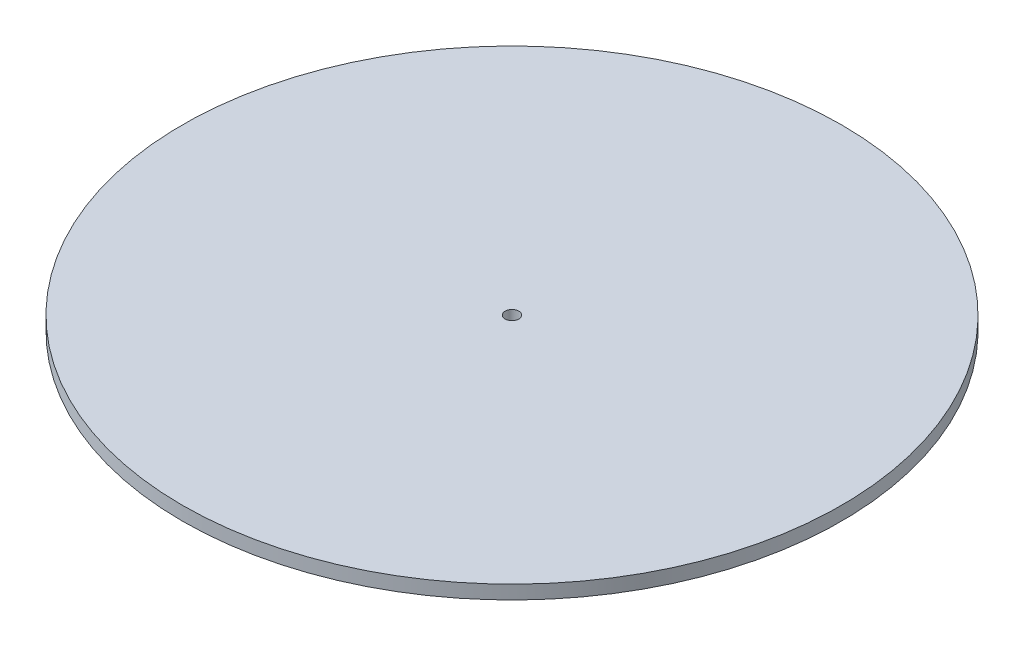
ISO-10303-21;
HEADER;
FILE_DESCRIPTION(('STEP AP214'),'2;1');
FILE_NAME('part.step','',(''),(''),'','','');
FILE_SCHEMA(('AUTOMOTIVE_DESIGN { 1 0 10303 214 1 1 1 1 }'));
ENDSEC;
DATA;
#1=APPLICATION_CONTEXT('core data for automotive mechanical design processes');
#2=APPLICATION_PROTOCOL_DEFINITION('international standard','automotive_design',2000,#1);
#3=PRODUCT_CONTEXT('',#1,'mechanical');
#4=PRODUCT('Part','Part','',(#3));
#5=PRODUCT_RELATED_PRODUCT_CATEGORY('part','',(#4));
#6=PRODUCT_DEFINITION_FORMATION('','',#4);
#7=PRODUCT_DEFINITION_CONTEXT('part definition',#1,'design');
#8=PRODUCT_DEFINITION('design','',#6,#7);
#9=PRODUCT_DEFINITION_SHAPE('','',#8);
#10=(LENGTH_UNIT() NAMED_UNIT(*) SI_UNIT(.MILLI.,.METRE.));
#11=(NAMED_UNIT(*) PLANE_ANGLE_UNIT() SI_UNIT($,.RADIAN.));
#12=(NAMED_UNIT(*) SI_UNIT($,.STERADIAN.) SOLID_ANGLE_UNIT());
#13=UNCERTAINTY_MEASURE_WITH_UNIT(LENGTH_MEASURE(1.E-05),#10,'distance_accuracy_value','');
#14=(GEOMETRIC_REPRESENTATION_CONTEXT(3) GLOBAL_UNCERTAINTY_ASSIGNED_CONTEXT((#13)) GLOBAL_UNIT_ASSIGNED_CONTEXT((#10,
#11,#12)) REPRESENTATION_CONTEXT('',''));
#15=CARTESIAN_POINT('',(0.,0.,0.));
#16=DIRECTION('',(0.,0.,1.));
#17=DIRECTION('',(1.,0.,0.));
#18=AXIS2_PLACEMENT_3D('',#15,#16,#17);
#19=CARTESIAN_POINT('',(0.,6.35,0.));
#20=DIRECTION('',(0.,1.,0.));
#21=DIRECTION('',(0.,0.,1.));
#22=AXIS2_PLACEMENT_3D('',#19,#20,#21);
#23=PLANE('',#22);
#24=CARTESIAN_POINT('',(0.,6.35,0.));
#25=DIRECTION('',(0.,1.,0.));
#26=DIRECTION('',(0.,0.,1.));
#27=AXIS2_PLACEMENT_3D('',#24,#25,#26);
#28=CIRCLE('',#27,152.4);
#29=CARTESIAN_POINT('',(0.,6.35,152.4));
#30=VERTEX_POINT('',#29);
#31=EDGE_CURVE('E10',#30,#30,#28,.T.);
#32=ORIENTED_EDGE('',*,*,#31,.T.);
#33=EDGE_LOOP('',(#32));
#34=FACE_BOUND('',#33,.T.);
#35=CARTESIAN_POINT('',(0.,6.35,0.));
#36=DIRECTION('',(0.,1.,0.));
#37=DIRECTION('',(0.,0.,1.));
#38=AXIS2_PLACEMENT_3D('',#35,#36,#37);
#39=CIRCLE('',#38,3.175);
#40=CARTESIAN_POINT('',(0.,6.35,3.175));
#41=VERTEX_POINT('',#40);
#42=EDGE_CURVE('E42',#41,#41,#39,.T.);
#43=ORIENTED_EDGE('',*,*,#42,.F.);
#44=EDGE_LOOP('',(#43));
#45=FACE_BOUND('',#44,.T.);
#46=ADVANCED_FACE('F31',(#34,#45),#23,.T.);
#47=CARTESIAN_POINT('',(0.,0.,0.));
#48=DIRECTION('',(0.,1.,0.));
#49=DIRECTION('',(0.,0.,1.));
#50=AXIS2_PLACEMENT_3D('',#47,#48,#49);
#51=PLANE('',#50);
#52=CARTESIAN_POINT('',(0.,0.,0.));
#53=DIRECTION('',(0.,1.,0.));
#54=DIRECTION('',(0.,0.,1.));
#55=AXIS2_PLACEMENT_3D('',#52,#53,#54);
#56=CIRCLE('',#55,152.4);
#57=CARTESIAN_POINT('',(0.,0.,152.4));
#58=VERTEX_POINT('',#57);
#59=EDGE_CURVE('E35',#58,#58,#56,.T.);
#60=ORIENTED_EDGE('',*,*,#59,.F.);
#61=EDGE_LOOP('',(#60));
#62=FACE_BOUND('',#61,.T.);
#63=CARTESIAN_POINT('',(0.,0.,0.));
#64=DIRECTION('',(0.,1.,0.));
#65=DIRECTION('',(0.,0.,1.));
#66=AXIS2_PLACEMENT_3D('',#63,#64,#65);
#67=CIRCLE('',#66,3.175);
#68=CARTESIAN_POINT('',(0.,0.,3.175));
#69=VERTEX_POINT('',#68);
#70=EDGE_CURVE('E44',#69,#69,#67,.T.);
#71=ORIENTED_EDGE('',*,*,#70,.T.);
#72=EDGE_LOOP('',(#71));
#73=FACE_BOUND('',#72,.T.);
#74=ADVANCED_FACE('F54',(#62,#73),#51,.F.);
#75=CARTESIAN_POINT('',(0.,6.35,0.));
#76=DIRECTION('',(0.,-1.,0.));
#77=DIRECTION('',(0.,0.,-1.));
#78=AXIS2_PLACEMENT_3D('',#75,#76,#77);
#79=CYLINDRICAL_SURFACE('',#78,152.4);
#80=ORIENTED_EDGE('',*,*,#31,.F.);
#81=EDGE_LOOP('',(#80));
#82=FACE_BOUND('',#81,.T.);
#83=ORIENTED_EDGE('',*,*,#59,.T.);
#84=EDGE_LOOP('',(#83));
#85=FACE_BOUND('',#84,.T.);
#86=ADVANCED_FACE('F33',(#82,#85),#79,.T.);
#87=CARTESIAN_POINT('',(0.,6.35,0.));
#88=DIRECTION('',(0.,-1.,0.));
#89=DIRECTION('',(0.,0.,-1.));
#90=AXIS2_PLACEMENT_3D('',#87,#88,#89);
#91=CYLINDRICAL_SURFACE('',#90,3.175);
#92=ORIENTED_EDGE('',*,*,#42,.T.);
#93=EDGE_LOOP('',(#92));
#94=FACE_BOUND('',#93,.T.);
#95=ORIENTED_EDGE('',*,*,#70,.F.);
#96=EDGE_LOOP('',(#95));
#97=FACE_BOUND('',#96,.T.);
#98=ADVANCED_FACE('F50',(#94,#97),#91,.F.);
#99=CLOSED_SHELL('',(#46,#74,#86,#98));
#100=MANIFOLD_SOLID_BREP('B2',#99);
#101=ADVANCED_BREP_SHAPE_REPRESENTATION('',(#18,#100),#14);
#102=SHAPE_DEFINITION_REPRESENTATION(#9,#101);
ENDSEC;
END-ISO-10303-21;
